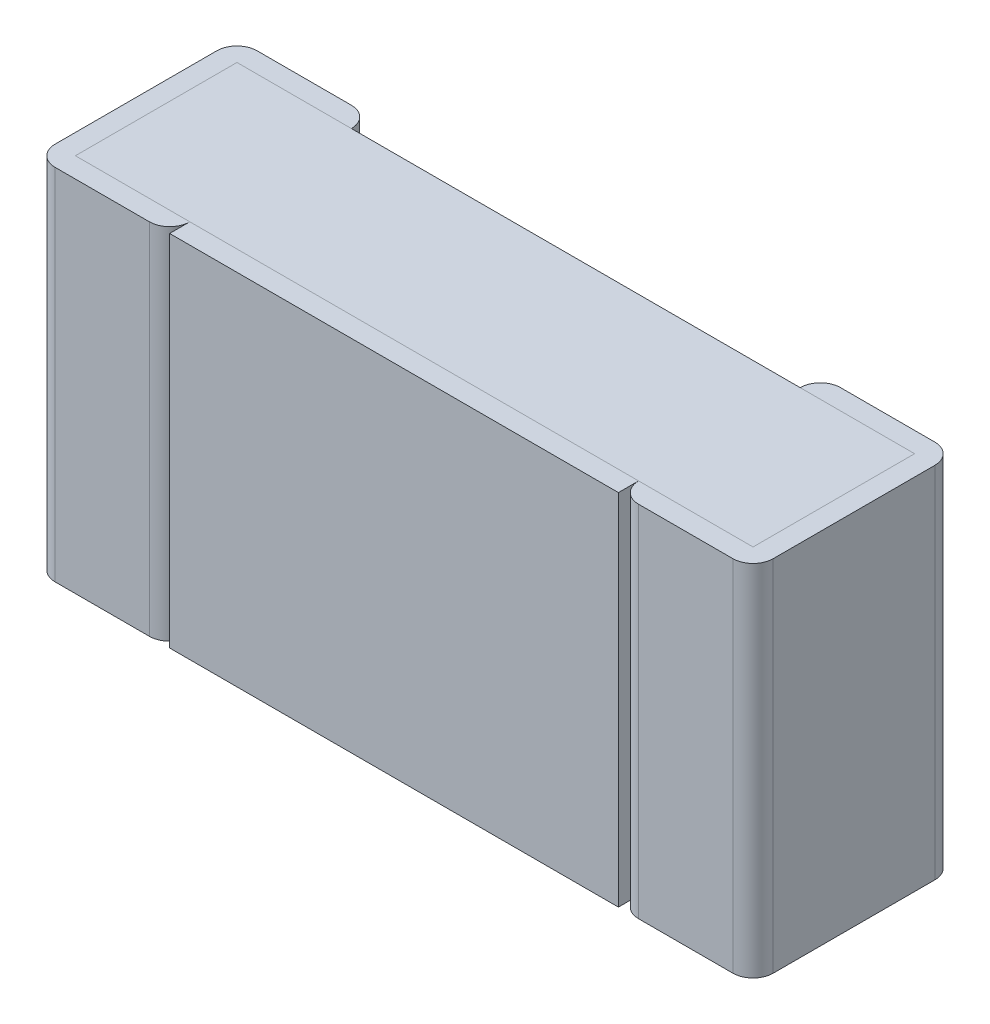
ISO-10303-21;
HEADER;
FILE_DESCRIPTION(('STEP AP214'),'2;1');
FILE_NAME('part.step','',(''),(''),'','','');
FILE_SCHEMA(('AUTOMOTIVE_DESIGN { 1 0 10303 214 1 1 1 1 }'));
ENDSEC;
DATA;
#1=APPLICATION_CONTEXT('core data for automotive mechanical design processes');
#2=APPLICATION_PROTOCOL_DEFINITION('international standard','automotive_design',2000,#1);
#3=PRODUCT_CONTEXT('',#1,'mechanical');
#4=PRODUCT('Part','Part','',(#3));
#5=PRODUCT_RELATED_PRODUCT_CATEGORY('part','',(#4));
#6=PRODUCT_DEFINITION_FORMATION('','',#4);
#7=PRODUCT_DEFINITION_CONTEXT('part definition',#1,'design');
#8=PRODUCT_DEFINITION('design','',#6,#7);
#9=PRODUCT_DEFINITION_SHAPE('','',#8);
#10=(LENGTH_UNIT() NAMED_UNIT(*) SI_UNIT(.MILLI.,.METRE.));
#11=(NAMED_UNIT(*) PLANE_ANGLE_UNIT() SI_UNIT($,.RADIAN.));
#12=(NAMED_UNIT(*) SI_UNIT($,.STERADIAN.) SOLID_ANGLE_UNIT());
#13=UNCERTAINTY_MEASURE_WITH_UNIT(LENGTH_MEASURE(1.E-05),#10,'distance_accuracy_value','');
#14=(GEOMETRIC_REPRESENTATION_CONTEXT(3) GLOBAL_UNCERTAINTY_ASSIGNED_CONTEXT((#13)) GLOBAL_UNIT_ASSIGNED_CONTEXT((#10,
#11,#12)) REPRESENTATION_CONTEXT('',''));
#15=CARTESIAN_POINT('',(0.,0.,0.));
#16=DIRECTION('',(0.,0.,1.));
#17=DIRECTION('',(1.,0.,0.));
#18=AXIS2_PLACEMENT_3D('',#15,#16,#17);
#19=CARTESIAN_POINT('',(136.568744279938,114.08604329235,112.661582908599));
#20=DIRECTION('',(0.,0.,1.));
#21=DIRECTION('',(1.,0.,0.));
#22=AXIS2_PLACEMENT_3D('',#19,#20,#21);
#23=PLANE('',#22);
#24=DIRECTION('',(0.,1.,0.));
#25=VECTOR('',#24,1.);
#26=CARTESIAN_POINT('',(136.568744279938,114.08604329235,112.661582908599));
#27=LINE('',#26,#25);
#28=CARTESIAN_POINT('',(136.568744279938,114.08604329235,112.661582908599));
#29=VERTEX_POINT('',#28);
#30=CARTESIAN_POINT('',(136.568744279938,114.88604329235,112.661582908599));
#31=VERTEX_POINT('',#30);
#32=EDGE_CURVE('E64',#29,#31,#27,.T.);
#33=ORIENTED_EDGE('',*,*,#32,.F.);
#34=DIRECTION('',(1.,0.,0.));
#35=VECTOR('',#34,1.);
#36=CARTESIAN_POINT('',(136.568744279938,114.08604329235,112.661582908599));
#37=LINE('',#36,#35);
#38=CARTESIAN_POINT('',(137.568744279938,114.08604329235,112.661582908599));
#39=VERTEX_POINT('',#38);
#40=EDGE_CURVE('E11',#29,#39,#37,.T.);
#41=ORIENTED_EDGE('',*,*,#40,.T.);
#42=DIRECTION('',(0.,1.,0.));
#43=VECTOR('',#42,1.);
#44=CARTESIAN_POINT('',(137.568744279938,114.08604329235,112.661582908599));
#45=LINE('',#44,#43);
#46=CARTESIAN_POINT('',(137.568744279938,114.88604329235,112.661582908599));
#47=VERTEX_POINT('',#46);
#48=EDGE_CURVE('E54',#39,#47,#45,.T.);
#49=ORIENTED_EDGE('',*,*,#48,.T.);
#50=DIRECTION('',(1.,0.,0.));
#51=VECTOR('',#50,1.);
#52=CARTESIAN_POINT('',(136.568744279938,114.88604329235,112.661582908599));
#53=LINE('',#52,#51);
#54=EDGE_CURVE('E327',#31,#47,#53,.T.);
#55=ORIENTED_EDGE('',*,*,#54,.F.);
#56=EDGE_LOOP('',(#33,#41,#49,#55));
#57=FACE_BOUND('',#56,.T.);
#58=ADVANCED_FACE('F44',(#57),#23,.T.);
#59=CARTESIAN_POINT('',(137.568744279938,114.08604329235,112.616582908599));
#60=DIRECTION('',(1.,0.,0.));
#61=DIRECTION('',(0.,1.,0.));
#62=AXIS2_PLACEMENT_3D('',#59,#60,#61);
#63=PLANE('',#62);
#64=DIRECTION('',(0.,0.,1.));
#65=VECTOR('',#64,1.);
#66=CARTESIAN_POINT('',(137.568744279938,114.08604329235,112.616582908599));
#67=LINE('',#66,#65);
#68=CARTESIAN_POINT('',(137.568744279938,114.08604329235,112.616582908599));
#69=VERTEX_POINT('',#68);
#70=EDGE_CURVE('E315',#69,#39,#67,.T.);
#71=ORIENTED_EDGE('',*,*,#70,.F.);
#72=DIRECTION('',(0.,1.,0.));
#73=VECTOR('',#72,1.);
#74=CARTESIAN_POINT('',(137.568744279938,114.08604329235,112.616582908599));
#75=LINE('',#74,#73);
#76=CARTESIAN_POINT('',(137.568744279938,114.88604329235,112.616582908599));
#77=VERTEX_POINT('',#76);
#78=EDGE_CURVE('E392',#69,#77,#75,.T.);
#79=ORIENTED_EDGE('',*,*,#78,.T.);
#80=DIRECTION('',(0.,0.,1.));
#81=VECTOR('',#80,1.);
#82=CARTESIAN_POINT('',(137.568744279938,114.88604329235,112.616582908599));
#83=LINE('',#82,#81);
#84=EDGE_CURVE('E389',#77,#47,#83,.T.);
#85=ORIENTED_EDGE('',*,*,#84,.T.);
#86=ORIENTED_EDGE('',*,*,#48,.F.);
#87=EDGE_LOOP('',(#71,#79,#85,#86));
#88=FACE_BOUND('',#87,.T.);
#89=ADVANCED_FACE('F523',(#88),#63,.T.);
#90=CARTESIAN_POINT('',(137.613744279938,114.08604329235,112.616582908599));
#91=DIRECTION('',(0.,1.,0.));
#92=DIRECTION('',(-1.,0.,0.));
#93=AXIS2_PLACEMENT_3D('',#90,#91,#92);
#94=CYLINDRICAL_SURFACE('',#93,0.0449999999999895);
#95=CARTESIAN_POINT('',(137.613744279938,114.08604329235,112.616582908599));
#96=DIRECTION('',(0.,1.,0.));
#97=DIRECTION('',(0.,0.,1.));
#98=AXIS2_PLACEMENT_3D('',#95,#96,#97);
#99=CIRCLE('',#98,0.0450000000000034);
#100=CARTESIAN_POINT('',(137.613744279938,114.08604329235,112.661582908599));
#101=VERTEX_POINT('',#100);
#102=EDGE_CURVE('E393',#69,#101,#99,.T.);
#103=ORIENTED_EDGE('',*,*,#102,.T.);
#104=DIRECTION('',(0.,1.,0.));
#105=VECTOR('',#104,1.);
#106=CARTESIAN_POINT('',(137.613744279938,114.08604329235,112.661582908599));
#107=LINE('',#106,#105);
#108=CARTESIAN_POINT('',(137.613744279938,114.88604329235,112.661582908599));
#109=VERTEX_POINT('',#108);
#110=EDGE_CURVE('E451',#101,#109,#107,.T.);
#111=ORIENTED_EDGE('',*,*,#110,.T.);
#112=CARTESIAN_POINT('',(137.613744279938,114.88604329235,112.616582908599));
#113=DIRECTION('',(0.,1.,0.));
#114=DIRECTION('',(0.,0.,1.));
#115=AXIS2_PLACEMENT_3D('',#112,#113,#114);
#116=CIRCLE('',#115,0.0450000000000034);
#117=EDGE_CURVE('E385',#77,#109,#116,.T.);
#118=ORIENTED_EDGE('',*,*,#117,.F.);
#119=ORIENTED_EDGE('',*,*,#78,.F.);
#120=EDGE_LOOP('',(#103,#111,#118,#119));
#121=FACE_BOUND('',#120,.T.);
#122=ADVANCED_FACE('F557',(#121),#94,.T.);
#123=CARTESIAN_POINT('',(137.568744279938,114.08604329235,112.661582908599));
#124=DIRECTION('',(0.,0.,1.));
#125=DIRECTION('',(1.,0.,0.));
#126=AXIS2_PLACEMENT_3D('',#123,#124,#125);
#127=PLANE('',#126);
#128=DIRECTION('',(1.,0.,0.));
#129=VECTOR('',#128,1.);
#130=CARTESIAN_POINT('',(137.568744279938,114.88604329235,112.661582908599));
#131=LINE('',#130,#129);
#132=CARTESIAN_POINT('',(137.823744279938,114.88604329235,112.661582908599));
#133=VERTEX_POINT('',#132);
#134=EDGE_CURVE('E382',#109,#133,#131,.T.);
#135=ORIENTED_EDGE('',*,*,#134,.F.);
#136=ORIENTED_EDGE('',*,*,#110,.F.);
#137=DIRECTION('',(1.,0.,0.));
#138=VECTOR('',#137,1.);
#139=CARTESIAN_POINT('',(137.568744279938,114.08604329235,112.661582908599));
#140=LINE('',#139,#138);
#141=CARTESIAN_POINT('',(137.823744279938,114.08604329235,112.661582908599));
#142=VERTEX_POINT('',#141);
#143=EDGE_CURVE('E455',#101,#142,#140,.T.);
#144=ORIENTED_EDGE('',*,*,#143,.T.);
#145=DIRECTION('',(0.,1.,0.));
#146=VECTOR('',#145,1.);
#147=CARTESIAN_POINT('',(137.823744279938,114.08604329235,112.661582908599));
#148=LINE('',#147,#146);
#149=EDGE_CURVE('E475',#142,#133,#148,.T.);
#150=ORIENTED_EDGE('',*,*,#149,.T.);
#151=EDGE_LOOP('',(#135,#136,#144,#150));
#152=FACE_BOUND('',#151,.T.);
#153=ADVANCED_FACE('F564',(#152),#127,.T.);
#154=CARTESIAN_POINT('',(137.823744279938,114.08604329235,112.616582908599));
#155=DIRECTION('',(0.,1.,0.));
#156=DIRECTION('',(1.,0.,0.));
#157=AXIS2_PLACEMENT_3D('',#154,#155,#156);
#158=CYLINDRICAL_SURFACE('',#157,0.0449999999999895);
#159=DIRECTION('',(0.,1.,0.));
#160=VECTOR('',#159,1.);
#161=CARTESIAN_POINT('',(137.868744279938,114.08604329235,112.616582908599));
#162=LINE('',#161,#160);
#163=CARTESIAN_POINT('',(137.868744279938,114.08604329235,112.616582908599));
#164=VERTEX_POINT('',#163);
#165=CARTESIAN_POINT('',(137.868744279938,114.88604329235,112.616582908599));
#166=VERTEX_POINT('',#165);
#167=EDGE_CURVE('E417',#164,#166,#162,.T.);
#168=ORIENTED_EDGE('',*,*,#167,.T.);
#169=CARTESIAN_POINT('',(137.823744279938,114.88604329235,112.616582908599));
#170=DIRECTION('',(0.,-1.,0.));
#171=DIRECTION('',(0.,0.,1.));
#172=AXIS2_PLACEMENT_3D('',#169,#170,#171);
#173=CIRCLE('',#172,0.0450000000000034);
#174=EDGE_CURVE('E413',#166,#133,#173,.T.);
#175=ORIENTED_EDGE('',*,*,#174,.T.);
#176=ORIENTED_EDGE('',*,*,#149,.F.);
#177=CARTESIAN_POINT('',(137.823744279938,114.08604329235,112.616582908599));
#178=DIRECTION('',(0.,-1.,0.));
#179=DIRECTION('',(0.,0.,1.));
#180=AXIS2_PLACEMENT_3D('',#177,#178,#179);
#181=CIRCLE('',#180,0.0450000000000034);
#182=EDGE_CURVE('E381',#164,#142,#181,.T.);
#183=ORIENTED_EDGE('',*,*,#182,.F.);
#184=EDGE_LOOP('',(#168,#175,#176,#183));
#185=FACE_BOUND('',#184,.T.);
#186=ADVANCED_FACE('F561',(#185),#158,.T.);
#187=CARTESIAN_POINT('',(137.868744279938,114.08604329235,112.211582908599));
#188=DIRECTION('',(1.,0.,0.));
#189=DIRECTION('',(0.,1.,0.));
#190=AXIS2_PLACEMENT_3D('',#187,#188,#189);
#191=PLANE('',#190);
#192=DIRECTION('',(0.,0.,1.));
#193=VECTOR('',#192,1.);
#194=CARTESIAN_POINT('',(137.868744279938,114.08604329235,112.211582908599));
#195=LINE('',#194,#193);
#196=CARTESIAN_POINT('',(137.868744279938,114.08604329235,112.256582908599));
#197=VERTEX_POINT('',#196);
#198=EDGE_CURVE('E376',#197,#164,#195,.T.);
#199=ORIENTED_EDGE('',*,*,#198,.F.);
#200=DIRECTION('',(0.,1.,0.));
#201=VECTOR('',#200,1.);
#202=CARTESIAN_POINT('',(137.868744279938,114.08604329235,112.256582908599));
#203=LINE('',#202,#201);
#204=CARTESIAN_POINT('',(137.868744279938,114.88604329235,112.256582908599));
#205=VERTEX_POINT('',#204);
#206=EDGE_CURVE('E418',#197,#205,#203,.T.);
#207=ORIENTED_EDGE('',*,*,#206,.T.);
#208=DIRECTION('',(0.,0.,1.));
#209=VECTOR('',#208,1.);
#210=CARTESIAN_POINT('',(137.868744279938,114.88604329235,112.211582908599));
#211=LINE('',#210,#209);
#212=EDGE_CURVE('E434',#205,#166,#211,.T.);
#213=ORIENTED_EDGE('',*,*,#212,.T.);
#214=ORIENTED_EDGE('',*,*,#167,.F.);
#215=EDGE_LOOP('',(#199,#207,#213,#214));
#216=FACE_BOUND('',#215,.T.);
#217=ADVANCED_FACE('F676',(#216),#191,.T.);
#218=CARTESIAN_POINT('',(137.823744279938,114.08604329235,112.256582908599));
#219=DIRECTION('',(0.,1.,0.));
#220=DIRECTION('',(1.,0.,0.));
#221=AXIS2_PLACEMENT_3D('',#218,#219,#220);
#222=CYLINDRICAL_SURFACE('',#221,0.0449999999999895);
#223=CARTESIAN_POINT('',(137.823744279938,114.08604329235,112.256582908599));
#224=DIRECTION('',(0.,1.,0.));
#225=DIRECTION('',(0.,0.,1.));
#226=AXIS2_PLACEMENT_3D('',#223,#224,#225);
#227=CIRCLE('',#226,0.0450000000000034);
#228=CARTESIAN_POINT('',(137.823744279938,114.08604329235,112.211582908599));
#229=VERTEX_POINT('',#228);
#230=EDGE_CURVE('E323',#197,#229,#227,.T.);
#231=ORIENTED_EDGE('',*,*,#230,.T.);
#232=DIRECTION('',(0.,1.,0.));
#233=VECTOR('',#232,1.);
#234=CARTESIAN_POINT('',(137.823744279938,114.08604329235,112.211582908599));
#235=LINE('',#234,#233);
#236=CARTESIAN_POINT('',(137.823744279938,114.88604329235,112.211582908599));
#237=VERTEX_POINT('',#236);
#238=EDGE_CURVE('E319',#229,#237,#235,.T.);
#239=ORIENTED_EDGE('',*,*,#238,.T.);
#240=CARTESIAN_POINT('',(137.823744279938,114.88604329235,112.256582908599));
#241=DIRECTION('',(0.,1.,0.));
#242=DIRECTION('',(0.,0.,1.));
#243=AXIS2_PLACEMENT_3D('',#240,#241,#242);
#244=CIRCLE('',#243,0.0450000000000034);
#245=EDGE_CURVE('E386',#205,#237,#244,.T.);
#246=ORIENTED_EDGE('',*,*,#245,.F.);
#247=ORIENTED_EDGE('',*,*,#206,.F.);
#248=EDGE_LOOP('',(#231,#239,#246,#247));
#249=FACE_BOUND('',#248,.T.);
#250=ADVANCED_FACE('F577',(#249),#222,.T.);
#251=CARTESIAN_POINT('',(137.568744279938,114.08604329235,112.211582908599));
#252=DIRECTION('',(0.,0.,1.));
#253=DIRECTION('',(1.,0.,0.));
#254=AXIS2_PLACEMENT_3D('',#251,#252,#253);
#255=PLANE('',#254);
#256=ORIENTED_EDGE('',*,*,#238,.F.);
#257=DIRECTION('',(1.,0.,0.));
#258=VECTOR('',#257,1.);
#259=CARTESIAN_POINT('',(137.568744279938,114.08604329235,112.211582908599));
#260=LINE('',#259,#258);
#261=CARTESIAN_POINT('',(137.613744279938,114.08604329235,112.211582908599));
#262=VERTEX_POINT('',#261);
#263=EDGE_CURVE('E48',#262,#229,#260,.T.);
#264=ORIENTED_EDGE('',*,*,#263,.F.);
#265=DIRECTION('',(0.,1.,0.));
#266=VECTOR('',#265,1.);
#267=CARTESIAN_POINT('',(137.613744279938,114.08604329235,112.211582908599));
#268=LINE('',#267,#266);
#269=CARTESIAN_POINT('',(137.613744279938,114.88604329235,112.211582908599));
#270=VERTEX_POINT('',#269);
#271=EDGE_CURVE('E324',#262,#270,#268,.T.);
#272=ORIENTED_EDGE('',*,*,#271,.T.);
#273=DIRECTION('',(1.,0.,0.));
#274=VECTOR('',#273,1.);
#275=CARTESIAN_POINT('',(137.568744279938,114.88604329235,112.211582908599));
#276=LINE('',#275,#274);
#277=EDGE_CURVE('E396',#270,#237,#276,.T.);
#278=ORIENTED_EDGE('',*,*,#277,.T.);
#279=EDGE_LOOP('',(#256,#264,#272,#278));
#280=FACE_BOUND('',#279,.T.);
#281=ADVANCED_FACE('F574',(#280),#255,.F.);
#282=CARTESIAN_POINT('',(137.613744279938,114.08604329235,112.256582908599));
#283=DIRECTION('',(0.,1.,0.));
#284=DIRECTION('',(-1.,0.,0.));
#285=AXIS2_PLACEMENT_3D('',#282,#283,#284);
#286=CYLINDRICAL_SURFACE('',#285,0.0449999999999895);
#287=DIRECTION('',(0.,1.,0.));
#288=VECTOR('',#287,1.);
#289=CARTESIAN_POINT('',(137.568744279938,114.08604329235,112.256582908599));
#290=LINE('',#289,#288);
#291=CARTESIAN_POINT('',(137.568744279938,114.08604329235,112.256582908599));
#292=VERTEX_POINT('',#291);
#293=CARTESIAN_POINT('',(137.568744279938,114.88604329235,112.256582908599));
#294=VERTEX_POINT('',#293);
#295=EDGE_CURVE('E400',#292,#294,#290,.T.);
#296=ORIENTED_EDGE('',*,*,#295,.T.);
#297=CARTESIAN_POINT('',(137.613744279938,114.88604329235,112.256582908599));
#298=DIRECTION('',(0.,-1.,0.));
#299=DIRECTION('',(0.,0.,1.));
#300=AXIS2_PLACEMENT_3D('',#297,#298,#299);
#301=CIRCLE('',#300,0.0450000000000034);
#302=EDGE_CURVE('E358',#294,#270,#301,.T.);
#303=ORIENTED_EDGE('',*,*,#302,.T.);
#304=ORIENTED_EDGE('',*,*,#271,.F.);
#305=CARTESIAN_POINT('',(137.613744279938,114.08604329235,112.256582908599));
#306=DIRECTION('',(0.,-1.,0.));
#307=DIRECTION('',(0.,0.,1.));
#308=AXIS2_PLACEMENT_3D('',#305,#306,#307);
#309=CIRCLE('',#308,0.0450000000000034);
#310=EDGE_CURVE('E447',#292,#262,#309,.T.);
#311=ORIENTED_EDGE('',*,*,#310,.F.);
#312=EDGE_LOOP('',(#296,#303,#304,#311));
#313=FACE_BOUND('',#312,.T.);
#314=ADVANCED_FACE('F538',(#313),#286,.T.);
#315=CARTESIAN_POINT('',(136.568744279938,114.88604329235,112.616582908599));
#316=DIRECTION('',(0.,1.,0.));
#317=DIRECTION('',(1.,0.,0.));
#318=AXIS2_PLACEMENT_3D('',#315,#316,#317);
#319=PLANE('',#318);
#320=DIRECTION('',(1.,0.,0.));
#321=VECTOR('',#320,1.);
#322=CARTESIAN_POINT('',(136.568744279938,114.88604329235,112.616582908599));
#323=LINE('',#322,#321);
#324=CARTESIAN_POINT('',(136.568744279938,114.88604329235,112.616582908599));
#325=VERTEX_POINT('',#324);
#326=EDGE_CURVE('E306',#325,#77,#323,.T.);
#327=ORIENTED_EDGE('',*,*,#326,.F.);
#328=DIRECTION('',(0.,0.,1.));
#329=VECTOR('',#328,1.);
#330=CARTESIAN_POINT('',(136.568744279938,114.88604329235,112.616582908599));
#331=LINE('',#330,#329);
#332=EDGE_CURVE('E354',#325,#31,#331,.T.);
#333=ORIENTED_EDGE('',*,*,#332,.T.);
#334=ORIENTED_EDGE('',*,*,#54,.T.);
#335=ORIENTED_EDGE('',*,*,#84,.F.);
#336=EDGE_LOOP('',(#327,#333,#334,#335));
#337=FACE_BOUND('',#336,.T.);
#338=ADVANCED_FACE('F46',(#337),#319,.T.);
#339=CARTESIAN_POINT('',(137.568744279938,114.88604329235,112.211582908599));
#340=DIRECTION('',(0.,1.,0.));
#341=DIRECTION('',(1.,0.,0.));
#342=AXIS2_PLACEMENT_3D('',#339,#340,#341);
#343=PLANE('',#342);
#344=ORIENTED_EDGE('',*,*,#277,.F.);
#345=ORIENTED_EDGE('',*,*,#302,.F.);
#346=DIRECTION('',(1.,0.,0.));
#347=VECTOR('',#346,1.);
#348=CARTESIAN_POINT('',(136.313744279938,114.88604329235,112.256582908599));
#349=LINE('',#348,#347);
#350=CARTESIAN_POINT('',(137.823744279938,114.88604329235,112.256582908599));
#351=VERTEX_POINT('',#350);
#352=EDGE_CURVE('E325',#294,#351,#349,.T.);
#353=ORIENTED_EDGE('',*,*,#352,.T.);
#354=DIRECTION('',(0.,0.,1.));
#355=VECTOR('',#354,1.);
#356=CARTESIAN_POINT('',(137.823744279938,114.88604329235,112.256582908599));
#357=LINE('',#356,#355);
#358=CARTESIAN_POINT('',(137.823744279938,114.88604329235,112.616582908599));
#359=VERTEX_POINT('',#358);
#360=EDGE_CURVE('E328',#351,#359,#357,.T.);
#361=ORIENTED_EDGE('',*,*,#360,.T.);
#362=DIRECTION('',(1.,0.,0.));
#363=VECTOR('',#362,1.);
#364=CARTESIAN_POINT('',(136.313744279938,114.88604329235,112.616582908599));
#365=LINE('',#364,#363);
#366=EDGE_CURVE('E310',#77,#359,#365,.T.);
#367=ORIENTED_EDGE('',*,*,#366,.F.);
#368=ORIENTED_EDGE('',*,*,#117,.T.);
#369=ORIENTED_EDGE('',*,*,#134,.T.);
#370=ORIENTED_EDGE('',*,*,#174,.F.);
#371=ORIENTED_EDGE('',*,*,#212,.F.);
#372=ORIENTED_EDGE('',*,*,#245,.T.);
#373=EDGE_LOOP('',(#344,#345,#353,#361,#367,#368,#369,#370,#371,#372));
#374=FACE_BOUND('',#373,.T.);
#375=ADVANCED_FACE('F528',(#374),#343,.T.);
#376=CARTESIAN_POINT('',(136.568744279938,114.08604329235,112.616582908599));
#377=DIRECTION('',(1.,0.,0.));
#378=DIRECTION('',(0.,1.,0.));
#379=AXIS2_PLACEMENT_3D('',#376,#377,#378);
#380=PLANE('',#379);
#381=ORIENTED_EDGE('',*,*,#32,.T.);
#382=ORIENTED_EDGE('',*,*,#332,.F.);
#383=DIRECTION('',(0.,1.,0.));
#384=VECTOR('',#383,1.);
#385=CARTESIAN_POINT('',(136.568744279938,114.08604329235,112.616582908599));
#386=LINE('',#385,#384);
#387=CARTESIAN_POINT('',(136.568744279938,114.08604329235,112.616582908599));
#388=VERTEX_POINT('',#387);
#389=EDGE_CURVE('E294',#388,#325,#386,.T.);
#390=ORIENTED_EDGE('',*,*,#389,.F.);
#391=DIRECTION('',(0.,0.,1.));
#392=VECTOR('',#391,1.);
#393=CARTESIAN_POINT('',(136.568744279938,114.08604329235,112.616582908599));
#394=LINE('',#393,#392);
#395=EDGE_CURVE('E311',#388,#29,#394,.T.);
#396=ORIENTED_EDGE('',*,*,#395,.T.);
#397=EDGE_LOOP('',(#381,#382,#390,#396));
#398=FACE_BOUND('',#397,.T.);
#399=ADVANCED_FACE('F517',(#398),#380,.F.);
#400=CARTESIAN_POINT('',(136.568744279938,114.08604329235,112.616582908599));
#401=DIRECTION('',(0.,1.,0.));
#402=DIRECTION('',(1.,0.,0.));
#403=AXIS2_PLACEMENT_3D('',#400,#401,#402);
#404=PLANE('',#403);
#405=ORIENTED_EDGE('',*,*,#70,.T.);
#406=ORIENTED_EDGE('',*,*,#40,.F.);
#407=ORIENTED_EDGE('',*,*,#395,.F.);
#408=DIRECTION('',(1.,0.,0.));
#409=VECTOR('',#408,1.);
#410=CARTESIAN_POINT('',(136.568744279938,114.08604329235,112.616582908599));
#411=LINE('',#410,#409);
#412=EDGE_CURVE('E380',#388,#69,#411,.T.);
#413=ORIENTED_EDGE('',*,*,#412,.T.);
#414=EDGE_LOOP('',(#405,#406,#407,#413));
#415=FACE_BOUND('',#414,.T.);
#416=ADVANCED_FACE('F548',(#415),#404,.F.);
#417=CARTESIAN_POINT('',(137.568744279938,114.08604329235,112.211582908599));
#418=DIRECTION('',(0.,1.,0.));
#419=DIRECTION('',(1.,0.,0.));
#420=AXIS2_PLACEMENT_3D('',#417,#418,#419);
#421=PLANE('',#420);
#422=ORIENTED_EDGE('',*,*,#230,.F.);
#423=ORIENTED_EDGE('',*,*,#198,.T.);
#424=ORIENTED_EDGE('',*,*,#182,.T.);
#425=ORIENTED_EDGE('',*,*,#143,.F.);
#426=ORIENTED_EDGE('',*,*,#102,.F.);
#427=DIRECTION('',(1.,0.,0.));
#428=VECTOR('',#427,1.);
#429=CARTESIAN_POINT('',(136.313744279938,114.08604329235,112.616582908599));
#430=LINE('',#429,#428);
#431=CARTESIAN_POINT('',(137.823744279938,114.08604329235,112.616582908599));
#432=VERTEX_POINT('',#431);
#433=EDGE_CURVE('E411',#69,#432,#430,.T.);
#434=ORIENTED_EDGE('',*,*,#433,.T.);
#435=DIRECTION('',(0.,0.,1.));
#436=VECTOR('',#435,1.);
#437=CARTESIAN_POINT('',(137.823744279938,114.08604329235,112.256582908599));
#438=LINE('',#437,#436);
#439=CARTESIAN_POINT('',(137.823744279938,114.08604329235,112.256582908599));
#440=VERTEX_POINT('',#439);
#441=EDGE_CURVE('E363',#440,#432,#438,.T.);
#442=ORIENTED_EDGE('',*,*,#441,.F.);
#443=DIRECTION('',(1.,0.,0.));
#444=VECTOR('',#443,1.);
#445=CARTESIAN_POINT('',(136.313744279938,114.08604329235,112.256582908599));
#446=LINE('',#445,#444);
#447=EDGE_CURVE('E359',#292,#440,#446,.T.);
#448=ORIENTED_EDGE('',*,*,#447,.F.);
#449=ORIENTED_EDGE('',*,*,#310,.T.);
#450=ORIENTED_EDGE('',*,*,#263,.T.);
#451=EDGE_LOOP('',(#422,#423,#424,#425,#426,#434,#442,#448,#449,#450));
#452=FACE_BOUND('',#451,.T.);
#453=ADVANCED_FACE('F541',(#452),#421,.F.);
#454=CARTESIAN_POINT('',(136.313744279938,114.08604329235,112.256582908599));
#455=DIRECTION('',(0.,0.,1.));
#456=DIRECTION('',(1.,0.,0.));
#457=AXIS2_PLACEMENT_3D('',#454,#455,#456);
#458=PLANE('',#457);
#459=DIRECTION('',(1.,0.,0.));
#460=VECTOR('',#459,1.);
#461=CARTESIAN_POINT('',(136.313744279938,114.88604329235,112.256582908599));
#462=LINE('',#461,#460);
#463=CARTESIAN_POINT('',(136.568744279938,114.88604329235,112.256582908599));
#464=VERTEX_POINT('',#463);
#465=EDGE_CURVE('E332',#464,#294,#462,.T.);
#466=ORIENTED_EDGE('',*,*,#465,.T.);
#467=ORIENTED_EDGE('',*,*,#295,.F.);
#468=DIRECTION('',(1.,0.,0.));
#469=VECTOR('',#468,1.);
#470=CARTESIAN_POINT('',(136.313744279938,114.08604329235,112.256582908599));
#471=LINE('',#470,#469);
#472=CARTESIAN_POINT('',(136.568744279938,114.08604329235,112.256582908599));
#473=VERTEX_POINT('',#472);
#474=EDGE_CURVE('E284',#473,#292,#471,.T.);
#475=ORIENTED_EDGE('',*,*,#474,.F.);
#476=DIRECTION('',(0.,1.,0.));
#477=VECTOR('',#476,1.);
#478=CARTESIAN_POINT('',(136.568744279938,114.08604329235,112.256582908599));
#479=LINE('',#478,#477);
#480=EDGE_CURVE('E329',#473,#464,#479,.T.);
#481=ORIENTED_EDGE('',*,*,#480,.T.);
#482=EDGE_LOOP('',(#466,#467,#475,#481));
#483=FACE_BOUND('',#482,.T.);
#484=ADVANCED_FACE('F539',(#483),#458,.F.);
#485=CARTESIAN_POINT('',(136.313744279938,114.88604329235,112.256582908599));
#486=DIRECTION('',(0.,1.,0.));
#487=DIRECTION('',(1.,0.,0.));
#488=AXIS2_PLACEMENT_3D('',#485,#486,#487);
#489=PLANE('',#488);
#490=DIRECTION('',(1.,0.,0.));
#491=VECTOR('',#490,1.);
#492=CARTESIAN_POINT('',(136.313744279938,114.88604329235,112.256582908599));
#493=LINE('',#492,#491);
#494=CARTESIAN_POINT('',(136.313744279938,114.88604329235,112.256582908599));
#495=VERTEX_POINT('',#494);
#496=EDGE_CURVE('E241',#495,#464,#493,.T.);
#497=ORIENTED_EDGE('',*,*,#496,.F.);
#498=DIRECTION('',(0.,0.,1.));
#499=VECTOR('',#498,1.);
#500=CARTESIAN_POINT('',(136.313744279938,114.88604329235,112.256582908599));
#501=LINE('',#500,#499);
#502=CARTESIAN_POINT('',(136.313744279938,114.88604329235,112.616582908599));
#503=VERTEX_POINT('',#502);
#504=EDGE_CURVE('E233',#495,#503,#501,.T.);
#505=ORIENTED_EDGE('',*,*,#504,.T.);
#506=DIRECTION('',(1.,0.,0.));
#507=VECTOR('',#506,1.);
#508=CARTESIAN_POINT('',(136.313744279938,114.88604329235,112.616582908599));
#509=LINE('',#508,#507);
#510=EDGE_CURVE('E309',#503,#325,#509,.T.);
#511=ORIENTED_EDGE('',*,*,#510,.T.);
#512=ORIENTED_EDGE('',*,*,#326,.T.);
#513=ORIENTED_EDGE('',*,*,#366,.T.);
#514=ORIENTED_EDGE('',*,*,#360,.F.);
#515=ORIENTED_EDGE('',*,*,#352,.F.);
#516=ORIENTED_EDGE('',*,*,#465,.F.);
#517=EDGE_LOOP('',(#497,#505,#511,#512,#513,#514,#515,#516));
#518=FACE_BOUND('',#517,.T.);
#519=ADVANCED_FACE('F513',(#518),#489,.T.);
#520=CARTESIAN_POINT('',(136.523744279938,114.08604329235,112.616582908599));
#521=DIRECTION('',(0.,1.,0.));
#522=DIRECTION('',(1.,0.,0.));
#523=AXIS2_PLACEMENT_3D('',#520,#521,#522);
#524=CYLINDRICAL_SURFACE('',#523,0.0449999999999895);
#525=ORIENTED_EDGE('',*,*,#389,.T.);
#526=CARTESIAN_POINT('',(136.523744279938,114.88604329235,112.616582908599));
#527=DIRECTION('',(0.,-1.,0.));
#528=DIRECTION('',(0.,0.,1.));
#529=AXIS2_PLACEMENT_3D('',#526,#527,#528);
#530=CIRCLE('',#529,0.0450000000000034);
#531=CARTESIAN_POINT('',(136.523744279938,114.88604329235,112.661582908599));
#532=VERTEX_POINT('',#531);
#533=EDGE_CURVE('E279',#325,#532,#530,.T.);
#534=ORIENTED_EDGE('',*,*,#533,.T.);
#535=DIRECTION('',(0.,1.,0.));
#536=VECTOR('',#535,1.);
#537=CARTESIAN_POINT('',(136.523744279938,114.08604329235,112.661582908599));
#538=LINE('',#537,#536);
#539=CARTESIAN_POINT('',(136.523744279938,114.08604329235,112.661582908599));
#540=VERTEX_POINT('',#539);
#541=EDGE_CURVE('E276',#540,#532,#538,.T.);
#542=ORIENTED_EDGE('',*,*,#541,.F.);
#543=CARTESIAN_POINT('',(136.523744279938,114.08604329235,112.616582908599));
#544=DIRECTION('',(0.,-1.,0.));
#545=DIRECTION('',(0.,0.,1.));
#546=AXIS2_PLACEMENT_3D('',#543,#544,#545);
#547=CIRCLE('',#546,0.0450000000000034);
#548=EDGE_CURVE('E260',#388,#540,#547,.T.);
#549=ORIENTED_EDGE('',*,*,#548,.F.);
#550=EDGE_LOOP('',(#525,#534,#542,#549));
#551=FACE_BOUND('',#550,.T.);
#552=ADVANCED_FACE('F277',(#551),#524,.T.);
#553=CARTESIAN_POINT('',(136.268744279938,114.08604329235,112.661582908599));
#554=DIRECTION('',(0.,0.,1.));
#555=DIRECTION('',(1.,0.,0.));
#556=AXIS2_PLACEMENT_3D('',#553,#554,#555);
#557=PLANE('',#556);
#558=DIRECTION('',(1.,0.,0.));
#559=VECTOR('',#558,1.);
#560=CARTESIAN_POINT('',(136.268744279938,114.88604329235,112.661582908599));
#561=LINE('',#560,#559);
#562=CARTESIAN_POINT('',(136.313744279938,114.88604329235,112.661582908599));
#563=VERTEX_POINT('',#562);
#564=EDGE_CURVE('E372',#563,#532,#561,.T.);
#565=ORIENTED_EDGE('',*,*,#564,.F.);
#566=DIRECTION('',(0.,1.,0.));
#567=VECTOR('',#566,1.);
#568=CARTESIAN_POINT('',(136.313744279938,114.08604329235,112.661582908599));
#569=LINE('',#568,#567);
#570=CARTESIAN_POINT('',(136.313744279938,114.08604329235,112.661582908599));
#571=VERTEX_POINT('',#570);
#572=EDGE_CURVE('E287',#571,#563,#569,.T.);
#573=ORIENTED_EDGE('',*,*,#572,.F.);
#574=DIRECTION('',(1.,0.,0.));
#575=VECTOR('',#574,1.);
#576=CARTESIAN_POINT('',(136.268744279938,114.08604329235,112.661582908599));
#577=LINE('',#576,#575);
#578=EDGE_CURVE('E266',#571,#540,#577,.T.);
#579=ORIENTED_EDGE('',*,*,#578,.T.);
#580=ORIENTED_EDGE('',*,*,#541,.T.);
#581=EDGE_LOOP('',(#565,#573,#579,#580));
#582=FACE_BOUND('',#581,.T.);
#583=ADVANCED_FACE('F286',(#582),#557,.T.);
#584=CARTESIAN_POINT('',(136.313744279938,114.08604329235,112.256582908599));
#585=DIRECTION('',(0.,1.,0.));
#586=DIRECTION('',(1.,0.,0.));
#587=AXIS2_PLACEMENT_3D('',#584,#585,#586);
#588=PLANE('',#587);
#589=ORIENTED_EDGE('',*,*,#474,.T.);
#590=ORIENTED_EDGE('',*,*,#447,.T.);
#591=ORIENTED_EDGE('',*,*,#441,.T.);
#592=ORIENTED_EDGE('',*,*,#433,.F.);
#593=ORIENTED_EDGE('',*,*,#412,.F.);
#594=DIRECTION('',(1.,0.,0.));
#595=VECTOR('',#594,1.);
#596=CARTESIAN_POINT('',(136.313744279938,114.08604329235,112.616582908599));
#597=LINE('',#596,#595);
#598=CARTESIAN_POINT('',(136.313744279938,114.08604329235,112.616582908599));
#599=VERTEX_POINT('',#598);
#600=EDGE_CURVE('E269',#599,#388,#597,.T.);
#601=ORIENTED_EDGE('',*,*,#600,.F.);
#602=DIRECTION('',(0.,0.,1.));
#603=VECTOR('',#602,1.);
#604=CARTESIAN_POINT('',(136.313744279938,114.08604329235,112.256582908599));
#605=LINE('',#604,#603);
#606=CARTESIAN_POINT('',(136.313744279938,114.08604329235,112.256582908599));
#607=VERTEX_POINT('',#606);
#608=EDGE_CURVE('E406',#607,#599,#605,.T.);
#609=ORIENTED_EDGE('',*,*,#608,.F.);
#610=DIRECTION('',(1.,0.,0.));
#611=VECTOR('',#610,1.);
#612=CARTESIAN_POINT('',(136.313744279938,114.08604329235,112.256582908599));
#613=LINE('',#612,#611);
#614=EDGE_CURVE('E437',#607,#473,#613,.T.);
#615=ORIENTED_EDGE('',*,*,#614,.T.);
#616=EDGE_LOOP('',(#589,#590,#591,#592,#593,#601,#609,#615));
#617=FACE_BOUND('',#616,.T.);
#618=ADVANCED_FACE('F586',(#617),#588,.F.);
#619=CARTESIAN_POINT('',(136.523744279938,114.08604329235,112.256582908599));
#620=DIRECTION('',(0.,1.,0.));
#621=DIRECTION('',(1.,0.,0.));
#622=AXIS2_PLACEMENT_3D('',#619,#620,#621);
#623=CYLINDRICAL_SURFACE('',#622,0.0449999999999895);
#624=CARTESIAN_POINT('',(136.523744279938,114.08604329235,112.256582908599));
#625=DIRECTION('',(0.,1.,0.));
#626=DIRECTION('',(0.,0.,1.));
#627=AXIS2_PLACEMENT_3D('',#624,#625,#626);
#628=CIRCLE('',#627,0.0450000000000034);
#629=CARTESIAN_POINT('',(136.523744279938,114.08604329235,112.211582908599));
#630=VERTEX_POINT('',#629);
#631=EDGE_CURVE('E318',#473,#630,#628,.T.);
#632=ORIENTED_EDGE('',*,*,#631,.T.);
#633=DIRECTION('',(0.,1.,0.));
#634=VECTOR('',#633,1.);
#635=CARTESIAN_POINT('',(136.523744279938,114.08604329235,112.211582908599));
#636=LINE('',#635,#634);
#637=CARTESIAN_POINT('',(136.523744279938,114.88604329235,112.211582908599));
#638=VERTEX_POINT('',#637);
#639=EDGE_CURVE('E156',#630,#638,#636,.T.);
#640=ORIENTED_EDGE('',*,*,#639,.T.);
#641=CARTESIAN_POINT('',(136.523744279938,114.88604329235,112.256582908599));
#642=DIRECTION('',(0.,1.,0.));
#643=DIRECTION('',(0.,0.,1.));
#644=AXIS2_PLACEMENT_3D('',#641,#642,#643);
#645=CIRCLE('',#644,0.0450000000000034);
#646=EDGE_CURVE('E146',#464,#638,#645,.T.);
#647=ORIENTED_EDGE('',*,*,#646,.F.);
#648=ORIENTED_EDGE('',*,*,#480,.F.);
#649=EDGE_LOOP('',(#632,#640,#647,#648));
#650=FACE_BOUND('',#649,.T.);
#651=ADVANCED_FACE('F569',(#650),#623,.T.);
#652=CARTESIAN_POINT('',(136.268744279938,114.08604329235,112.211582908599));
#653=DIRECTION('',(0.,0.,1.));
#654=DIRECTION('',(1.,0.,0.));
#655=AXIS2_PLACEMENT_3D('',#652,#653,#654);
#656=PLANE('',#655);
#657=ORIENTED_EDGE('',*,*,#639,.F.);
#658=DIRECTION('',(1.,0.,0.));
#659=VECTOR('',#658,1.);
#660=CARTESIAN_POINT('',(136.268744279938,114.08604329235,112.211582908599));
#661=LINE('',#660,#659);
#662=CARTESIAN_POINT('',(136.313744279938,114.08604329235,112.211582908599));
#663=VERTEX_POINT('',#662);
#664=EDGE_CURVE('E352',#663,#630,#661,.T.);
#665=ORIENTED_EDGE('',*,*,#664,.F.);
#666=DIRECTION('',(0.,1.,0.));
#667=VECTOR('',#666,1.);
#668=CARTESIAN_POINT('',(136.313744279938,114.08604329235,112.211582908599));
#669=LINE('',#668,#667);
#670=CARTESIAN_POINT('',(136.313744279938,114.88604329235,112.211582908599));
#671=VERTEX_POINT('',#670);
#672=EDGE_CURVE('E298',#663,#671,#669,.T.);
#673=ORIENTED_EDGE('',*,*,#672,.T.);
#674=DIRECTION('',(1.,0.,0.));
#675=VECTOR('',#674,1.);
#676=CARTESIAN_POINT('',(136.268744279938,114.88604329235,112.211582908599));
#677=LINE('',#676,#675);
#678=EDGE_CURVE('E368',#671,#638,#677,.T.);
#679=ORIENTED_EDGE('',*,*,#678,.T.);
#680=EDGE_LOOP('',(#657,#665,#673,#679));
#681=FACE_BOUND('',#680,.T.);
#682=ADVANCED_FACE('F499',(#681),#656,.F.);
#683=CARTESIAN_POINT('',(136.268744279938,114.88604329235,112.211582908599));
#684=DIRECTION('',(0.,1.,0.));
#685=DIRECTION('',(1.,0.,0.));
#686=AXIS2_PLACEMENT_3D('',#683,#684,#685);
#687=PLANE('',#686);
#688=ORIENTED_EDGE('',*,*,#678,.F.);
#689=CARTESIAN_POINT('',(136.313744279938,114.88604329235,112.256582908599));
#690=DIRECTION('',(0.,-1.,0.));
#691=DIRECTION('',(0.,0.,1.));
#692=AXIS2_PLACEMENT_3D('',#689,#690,#691);
#693=CIRCLE('',#692,0.0450000000000034);
#694=CARTESIAN_POINT('',(136.268744279938,114.88604329235,112.256582908599));
#695=VERTEX_POINT('',#694);
#696=EDGE_CURVE('E305',#695,#671,#693,.T.);
#697=ORIENTED_EDGE('',*,*,#696,.F.);
#698=DIRECTION('',(0.,0.,1.));
#699=VECTOR('',#698,1.);
#700=CARTESIAN_POINT('',(136.268744279938,114.88604329235,112.211582908599));
#701=LINE('',#700,#699);
#702=CARTESIAN_POINT('',(136.268744279938,114.88604329235,112.616582908599));
#703=VERTEX_POINT('',#702);
#704=EDGE_CURVE('E364',#695,#703,#701,.T.);
#705=ORIENTED_EDGE('',*,*,#704,.T.);
#706=CARTESIAN_POINT('',(136.313744279938,114.88604329235,112.616582908599));
#707=DIRECTION('',(0.,1.,0.));
#708=DIRECTION('',(0.,0.,1.));
#709=AXIS2_PLACEMENT_3D('',#706,#707,#708);
#710=CIRCLE('',#709,0.0450000000000034);
#711=EDGE_CURVE('E369',#703,#563,#710,.T.);
#712=ORIENTED_EDGE('',*,*,#711,.T.);
#713=ORIENTED_EDGE('',*,*,#564,.T.);
#714=ORIENTED_EDGE('',*,*,#533,.F.);
#715=ORIENTED_EDGE('',*,*,#510,.F.);
#716=ORIENTED_EDGE('',*,*,#504,.F.);
#717=ORIENTED_EDGE('',*,*,#496,.T.);
#718=ORIENTED_EDGE('',*,*,#646,.T.);
#719=EDGE_LOOP('',(#688,#697,#705,#712,#713,#714,#715,#716,#717,#718));
#720=FACE_BOUND('',#719,.T.);
#721=ADVANCED_FACE('F507',(#720),#687,.T.);
#722=CARTESIAN_POINT('',(136.313744279938,114.08604329235,112.616582908599));
#723=DIRECTION('',(0.,1.,0.));
#724=DIRECTION('',(-1.,0.,0.));
#725=AXIS2_PLACEMENT_3D('',#722,#723,#724);
#726=CYLINDRICAL_SURFACE('',#725,0.0449999999999895);
#727=CARTESIAN_POINT('',(136.313744279938,114.08604329235,112.616582908599));
#728=DIRECTION('',(0.,1.,0.));
#729=DIRECTION('',(0.,0.,1.));
#730=AXIS2_PLACEMENT_3D('',#727,#728,#729);
#731=CIRCLE('',#730,0.0450000000000034);
#732=CARTESIAN_POINT('',(136.268744279938,114.08604329235,112.616582908599));
#733=VERTEX_POINT('',#732);
#734=EDGE_CURVE('E299',#733,#571,#731,.T.);
#735=ORIENTED_EDGE('',*,*,#734,.T.);
#736=ORIENTED_EDGE('',*,*,#572,.T.);
#737=ORIENTED_EDGE('',*,*,#711,.F.);
#738=DIRECTION('',(0.,1.,0.));
#739=VECTOR('',#738,1.);
#740=CARTESIAN_POINT('',(136.268744279938,114.08604329235,112.616582908599));
#741=LINE('',#740,#739);
#742=EDGE_CURVE('E349',#733,#703,#741,.T.);
#743=ORIENTED_EDGE('',*,*,#742,.F.);
#744=EDGE_LOOP('',(#735,#736,#737,#743));
#745=FACE_BOUND('',#744,.T.);
#746=ADVANCED_FACE('F511',(#745),#726,.T.);
#747=CARTESIAN_POINT('',(136.313744279938,114.08604329235,112.256582908599));
#748=DIRECTION('',(0.,1.,0.));
#749=DIRECTION('',(-1.,0.,0.));
#750=AXIS2_PLACEMENT_3D('',#747,#748,#749);
#751=CYLINDRICAL_SURFACE('',#750,0.0449999999999895);
#752=DIRECTION('',(0.,1.,0.));
#753=VECTOR('',#752,1.);
#754=CARTESIAN_POINT('',(136.268744279938,114.08604329235,112.256582908599));
#755=LINE('',#754,#753);
#756=CARTESIAN_POINT('',(136.268744279938,114.08604329235,112.256582908599));
#757=VERTEX_POINT('',#756);
#758=EDGE_CURVE('E301',#757,#695,#755,.T.);
#759=ORIENTED_EDGE('',*,*,#758,.T.);
#760=ORIENTED_EDGE('',*,*,#696,.T.);
#761=ORIENTED_EDGE('',*,*,#672,.F.);
#762=CARTESIAN_POINT('',(136.313744279938,114.08604329235,112.256582908599));
#763=DIRECTION('',(0.,-1.,0.));
#764=DIRECTION('',(0.,0.,1.));
#765=AXIS2_PLACEMENT_3D('',#762,#763,#764);
#766=CIRCLE('',#765,0.0450000000000034);
#767=EDGE_CURVE('E273',#757,#663,#766,.T.);
#768=ORIENTED_EDGE('',*,*,#767,.F.);
#769=EDGE_LOOP('',(#759,#760,#761,#768));
#770=FACE_BOUND('',#769,.T.);
#771=ADVANCED_FACE('F501',(#770),#751,.T.);
#772=CARTESIAN_POINT('',(136.268744279938,114.08604329235,112.211582908599));
#773=DIRECTION('',(0.,1.,0.));
#774=DIRECTION('',(1.,0.,0.));
#775=AXIS2_PLACEMENT_3D('',#772,#773,#774);
#776=PLANE('',#775);
#777=ORIENTED_EDGE('',*,*,#631,.F.);
#778=ORIENTED_EDGE('',*,*,#614,.F.);
#779=ORIENTED_EDGE('',*,*,#608,.T.);
#780=ORIENTED_EDGE('',*,*,#600,.T.);
#781=ORIENTED_EDGE('',*,*,#548,.T.);
#782=ORIENTED_EDGE('',*,*,#578,.F.);
#783=ORIENTED_EDGE('',*,*,#734,.F.);
#784=DIRECTION('',(0.,0.,1.));
#785=VECTOR('',#784,1.);
#786=CARTESIAN_POINT('',(136.268744279938,114.08604329235,112.211582908599));
#787=LINE('',#786,#785);
#788=EDGE_CURVE('E353',#757,#733,#787,.T.);
#789=ORIENTED_EDGE('',*,*,#788,.F.);
#790=ORIENTED_EDGE('',*,*,#767,.T.);
#791=ORIENTED_EDGE('',*,*,#664,.T.);
#792=EDGE_LOOP('',(#777,#778,#779,#780,#781,#782,#783,#789,#790,#791));
#793=FACE_BOUND('',#792,.T.);
#794=ADVANCED_FACE('F263',(#793),#776,.F.);
#795=CARTESIAN_POINT('',(136.268744279938,114.08604329235,112.211582908599));
#796=DIRECTION('',(1.,0.,0.));
#797=DIRECTION('',(0.,1.,0.));
#798=AXIS2_PLACEMENT_3D('',#795,#796,#797);
#799=PLANE('',#798);
#800=ORIENTED_EDGE('',*,*,#742,.T.);
#801=ORIENTED_EDGE('',*,*,#704,.F.);
#802=ORIENTED_EDGE('',*,*,#758,.F.);
#803=ORIENTED_EDGE('',*,*,#788,.T.);
#804=EDGE_LOOP('',(#800,#801,#802,#803));
#805=FACE_BOUND('',#804,.T.);
#806=ADVANCED_FACE('F509',(#805),#799,.F.);
#807=CLOSED_SHELL('',(#58,#89,#122,#153,#186,#217,#250,#281,#314,#338,#375,#399,#416,#453,#484,
#519,#552,#583,#618,#651,#682,#721,#746,#771,#794,#806));
#808=MANIFOLD_SOLID_BREP('B2',#807);
#809=ADVANCED_BREP_SHAPE_REPRESENTATION('',(#18,#808),#14);
#810=SHAPE_DEFINITION_REPRESENTATION(#9,#809);
ENDSEC;
END-ISO-10303-21;
